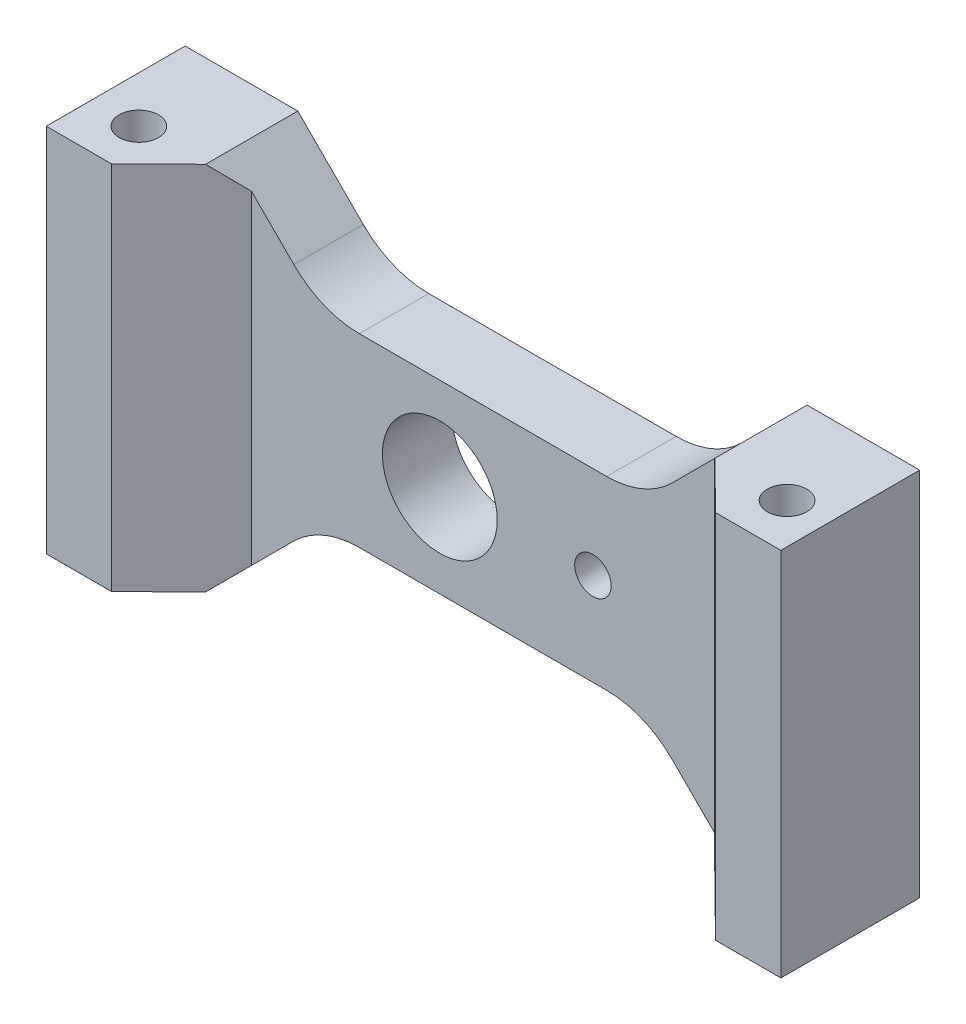
ISO-10303-21;
HEADER;
FILE_DESCRIPTION(('STEP AP214'),'2;1');
FILE_NAME('part.step','',(''),(''),'','','');
FILE_SCHEMA(('AUTOMOTIVE_DESIGN { 1 0 10303 214 1 1 1 1 }'));
ENDSEC;
DATA;
#1=APPLICATION_CONTEXT('core data for automotive mechanical design processes');
#2=APPLICATION_PROTOCOL_DEFINITION('international standard','automotive_design',2000,#1);
#3=PRODUCT_CONTEXT('',#1,'mechanical');
#4=PRODUCT('Part','Part','',(#3));
#5=PRODUCT_RELATED_PRODUCT_CATEGORY('part','',(#4));
#6=PRODUCT_DEFINITION_FORMATION('','',#4);
#7=PRODUCT_DEFINITION_CONTEXT('part definition',#1,'design');
#8=PRODUCT_DEFINITION('design','',#6,#7);
#9=PRODUCT_DEFINITION_SHAPE('','',#8);
#10=(LENGTH_UNIT() NAMED_UNIT(*) SI_UNIT(.MILLI.,.METRE.));
#11=(NAMED_UNIT(*) PLANE_ANGLE_UNIT() SI_UNIT($,.RADIAN.));
#12=(NAMED_UNIT(*) SI_UNIT($,.STERADIAN.) SOLID_ANGLE_UNIT());
#13=UNCERTAINTY_MEASURE_WITH_UNIT(LENGTH_MEASURE(1.E-05),#10,'distance_accuracy_value','');
#14=(GEOMETRIC_REPRESENTATION_CONTEXT(3) GLOBAL_UNCERTAINTY_ASSIGNED_CONTEXT((#13)) GLOBAL_UNIT_ASSIGNED_CONTEXT((#10,
#11,#12)) REPRESENTATION_CONTEXT('',''));
#15=CARTESIAN_POINT('',(0.,0.,0.));
#16=DIRECTION('',(0.,0.,1.));
#17=DIRECTION('',(1.,0.,0.));
#18=AXIS2_PLACEMENT_3D('',#15,#16,#17);
#19=CARTESIAN_POINT('',(0.,25.4,0.));
#20=DIRECTION('',(0.,-1.,0.));
#21=DIRECTION('',(0.,0.,-1.));
#22=AXIS2_PLACEMENT_3D('',#19,#20,#21);
#23=PLANE('',#22);
#24=CARTESIAN_POINT('',(-22.0123153285078,25.4,6.35));
#25=DIRECTION('',(0.,1.,0.));
#26=DIRECTION('',(0.,0.,1.));
#27=AXIS2_PLACEMENT_3D('',#24,#25,#26);
#28=CIRCLE('',#27,1.35255);
#29=CARTESIAN_POINT('',(-22.0123153285078,25.4,7.70255));
#30=VERTEX_POINT('',#29);
#31=EDGE_CURVE('E364',#30,#30,#28,.T.);
#32=ORIENTED_EDGE('',*,*,#31,.F.);
#33=EDGE_LOOP('',(#32));
#34=FACE_BOUND('',#33,.T.);
#35=DIRECTION('',(0.712536988742524,0.,-0.701634548517771));
#36=VECTOR('',#35,1.);
#37=CARTESIAN_POINT('',(-20.7115027293127,25.4,9.52500000000001));
#38=LINE('',#37,#36);
#39=CARTESIAN_POINT('',(-20.7115027293127,25.4,9.52500000000001));
#40=VERTEX_POINT('',#39);
#41=CARTESIAN_POINT('',(-17.4625,25.4,6.3257098590947));
#42=VERTEX_POINT('',#41);
#43=EDGE_CURVE('E371',#40,#42,#38,.T.);
#44=ORIENTED_EDGE('',*,*,#43,.T.);
#45=DIRECTION('',(0.,0.,-1.));
#46=VECTOR('',#45,1.);
#47=CARTESIAN_POINT('',(-17.4625,25.4,9.52500000000001));
#48=LINE('',#47,#46);
#49=CARTESIAN_POINT('',(-17.4625,25.4,0.));
#50=VERTEX_POINT('',#49);
#51=EDGE_CURVE('E251',#42,#50,#48,.T.);
#52=ORIENTED_EDGE('',*,*,#51,.T.);
#53=DIRECTION('',(-1.,0.,0.));
#54=VECTOR('',#53,1.);
#55=CARTESIAN_POINT('',(25.1873153285078,25.4,0.));
#56=LINE('',#55,#54);
#57=CARTESIAN_POINT('',(-25.1873153285078,25.4,0.));
#58=VERTEX_POINT('',#57);
#59=EDGE_CURVE('E382',#50,#58,#56,.T.);
#60=ORIENTED_EDGE('',*,*,#59,.T.);
#61=DIRECTION('',(0.,0.,1.));
#62=VECTOR('',#61,1.);
#63=CARTESIAN_POINT('',(-25.1873153285078,25.4,0.));
#64=LINE('',#63,#62);
#65=CARTESIAN_POINT('',(-25.1873153285078,25.4,9.52500000000001));
#66=VERTEX_POINT('',#65);
#67=EDGE_CURVE('E385',#58,#66,#64,.T.);
#68=ORIENTED_EDGE('',*,*,#67,.T.);
#69=DIRECTION('',(1.,0.,0.));
#70=VECTOR('',#69,1.);
#71=CARTESIAN_POINT('',(-25.1873153285078,25.4,9.52500000000001));
#72=LINE('',#71,#70);
#73=EDGE_CURVE('E387',#66,#40,#72,.T.);
#74=ORIENTED_EDGE('',*,*,#73,.T.);
#75=EDGE_LOOP('',(#44,#52,#60,#68,#74));
#76=FACE_BOUND('',#75,.T.);
#77=ADVANCED_FACE('F55',(#34,#76),#23,.F.);
#78=CARTESIAN_POINT('',(0.,0.,0.));
#79=DIRECTION('',(0.,-1.,0.));
#80=DIRECTION('',(0.,0.,-1.));
#81=AXIS2_PLACEMENT_3D('',#78,#79,#80);
#82=PLANE('',#81);
#83=DIRECTION('',(0.,0.,-1.));
#84=VECTOR('',#83,1.);
#85=CARTESIAN_POINT('',(17.4625,0.,9.52500000000001));
#86=LINE('',#85,#84);
#87=CARTESIAN_POINT('',(17.4625,0.,6.3257098590947));
#88=VERTEX_POINT('',#87);
#89=CARTESIAN_POINT('',(17.4625,0.,0.));
#90=VERTEX_POINT('',#89);
#91=EDGE_CURVE('E278',#88,#90,#86,.T.);
#92=ORIENTED_EDGE('',*,*,#91,.T.);
#93=DIRECTION('',(-1.,0.,0.));
#94=VECTOR('',#93,1.);
#95=CARTESIAN_POINT('',(25.1873153285078,0.,0.));
#96=LINE('',#95,#94);
#97=CARTESIAN_POINT('',(25.1873153285078,0.,0.));
#98=VERTEX_POINT('',#97);
#99=EDGE_CURVE('E401',#98,#90,#96,.T.);
#100=ORIENTED_EDGE('',*,*,#99,.F.);
#101=DIRECTION('',(0.,0.,-1.));
#102=VECTOR('',#101,1.);
#103=CARTESIAN_POINT('',(25.1873153285078,0.,9.52499999999999));
#104=LINE('',#103,#102);
#105=CARTESIAN_POINT('',(25.1873153285078,0.,9.52499999999999));
#106=VERTEX_POINT('',#105);
#107=EDGE_CURVE('E398',#106,#98,#104,.T.);
#108=ORIENTED_EDGE('',*,*,#107,.F.);
#109=DIRECTION('',(1.,0.,0.));
#110=VECTOR('',#109,1.);
#111=CARTESIAN_POINT('',(20.7115027293127,0.,9.525));
#112=LINE('',#111,#110);
#113=CARTESIAN_POINT('',(20.7115027293127,0.,9.525));
#114=VERTEX_POINT('',#113);
#115=EDGE_CURVE('E396',#114,#106,#112,.T.);
#116=ORIENTED_EDGE('',*,*,#115,.F.);
#117=DIRECTION('',(0.712536988742524,0.,0.701634548517771));
#118=VECTOR('',#117,1.);
#119=CARTESIAN_POINT('',(15.875,0.,4.76249999999999));
#120=LINE('',#119,#118);
#121=EDGE_CURVE('E394',#88,#114,#120,.T.);
#122=ORIENTED_EDGE('',*,*,#121,.F.);
#123=EDGE_LOOP('',(#92,#100,#108,#116,#122));
#124=FACE_BOUND('',#123,.T.);
#125=CARTESIAN_POINT('',(22.4376846714922,0.,6.35));
#126=DIRECTION('',(0.,1.,0.));
#127=DIRECTION('',(0.,0.,1.));
#128=AXIS2_PLACEMENT_3D('',#125,#126,#127);
#129=CIRCLE('',#128,1.35255);
#130=CARTESIAN_POINT('',(22.4376846714922,0.,7.70255));
#131=VERTEX_POINT('',#130);
#132=EDGE_CURVE('E354',#131,#131,#129,.T.);
#133=ORIENTED_EDGE('',*,*,#132,.T.);
#134=EDGE_LOOP('',(#133));
#135=FACE_BOUND('',#134,.T.);
#136=ADVANCED_FACE('F447',(#124,#135),#82,.T.);
#137=CARTESIAN_POINT('',(25.1873153285078,25.4,0.));
#138=VERTEX_POINT('',#137);
#139=CARTESIAN_POINT('',(17.4625,25.4,0.));
#140=VERTEX_POINT('',#139);
#141=EDGE_CURVE('E383',#138,#140,#56,.T.);
#142=ORIENTED_EDGE('',*,*,#141,.T.);
#143=DIRECTION('',(0.,0.,-1.));
#144=VECTOR('',#143,1.);
#145=CARTESIAN_POINT('',(17.4625,25.4,9.52500000000001));
#146=LINE('',#145,#144);
#147=CARTESIAN_POINT('',(17.4625,25.4,6.32570985909469));
#148=VERTEX_POINT('',#147);
#149=EDGE_CURVE('E71',#148,#140,#146,.T.);
#150=ORIENTED_EDGE('',*,*,#149,.F.);
#151=DIRECTION('',(0.712536988742524,0.,0.701634548517771));
#152=VECTOR('',#151,1.);
#153=CARTESIAN_POINT('',(15.875,25.4,4.76249999999999));
#154=LINE('',#153,#152);
#155=CARTESIAN_POINT('',(20.7115027293127,25.4,9.525));
#156=VERTEX_POINT('',#155);
#157=EDGE_CURVE('E375',#148,#156,#154,.T.);
#158=ORIENTED_EDGE('',*,*,#157,.T.);
#159=DIRECTION('',(1.,0.,0.));
#160=VECTOR('',#159,1.);
#161=CARTESIAN_POINT('',(20.7115027293127,25.4,9.525));
#162=LINE('',#161,#160);
#163=CARTESIAN_POINT('',(25.1873153285078,25.4,9.52499999999999));
#164=VERTEX_POINT('',#163);
#165=EDGE_CURVE('E378',#156,#164,#162,.T.);
#166=ORIENTED_EDGE('',*,*,#165,.T.);
#167=DIRECTION('',(0.,0.,-1.));
#168=VECTOR('',#167,1.);
#169=CARTESIAN_POINT('',(25.1873153285078,25.4,9.52499999999999));
#170=LINE('',#169,#168);
#171=EDGE_CURVE('E380',#164,#138,#170,.T.);
#172=ORIENTED_EDGE('',*,*,#171,.T.);
#173=EDGE_LOOP('',(#142,#150,#158,#166,#172));
#174=FACE_BOUND('',#173,.T.);
#175=CARTESIAN_POINT('',(22.4376846714922,25.4,6.35));
#176=DIRECTION('',(0.,1.,0.));
#177=DIRECTION('',(0.,0.,1.));
#178=AXIS2_PLACEMENT_3D('',#175,#176,#177);
#179=CIRCLE('',#178,1.35255);
#180=CARTESIAN_POINT('',(22.4376846714922,25.4,7.70255));
#181=VERTEX_POINT('',#180);
#182=EDGE_CURVE('E358',#181,#181,#179,.T.);
#183=ORIENTED_EDGE('',*,*,#182,.F.);
#184=EDGE_LOOP('',(#183));
#185=FACE_BOUND('',#184,.T.);
#186=ADVANCED_FACE('F458',(#174,#185),#23,.F.);
#187=DIRECTION('',(0.,0.,-1.));
#188=VECTOR('',#187,1.);
#189=CARTESIAN_POINT('',(-17.4625,0.,9.52500000000001));
#190=LINE('',#189,#188);
#191=CARTESIAN_POINT('',(-17.4625,0.,6.3257098590947));
#192=VERTEX_POINT('',#191);
#193=CARTESIAN_POINT('',(-17.4625,0.,0.));
#194=VERTEX_POINT('',#193);
#195=EDGE_CURVE('E82',#192,#194,#190,.T.);
#196=ORIENTED_EDGE('',*,*,#195,.F.);
#197=DIRECTION('',(0.712536988742524,0.,-0.701634548517771));
#198=VECTOR('',#197,1.);
#199=CARTESIAN_POINT('',(-20.7115027293127,0.,9.52500000000001));
#200=LINE('',#199,#198);
#201=CARTESIAN_POINT('',(-20.7115027293127,0.,9.52500000000001));
#202=VERTEX_POINT('',#201);
#203=EDGE_CURVE('E367',#202,#192,#200,.T.);
#204=ORIENTED_EDGE('',*,*,#203,.F.);
#205=DIRECTION('',(1.,0.,0.));
#206=VECTOR('',#205,1.);
#207=CARTESIAN_POINT('',(-25.1873153285078,0.,9.52500000000001));
#208=LINE('',#207,#206);
#209=CARTESIAN_POINT('',(-25.1873153285078,0.,9.52500000000001));
#210=VERTEX_POINT('',#209);
#211=EDGE_CURVE('E376',#210,#202,#208,.T.);
#212=ORIENTED_EDGE('',*,*,#211,.F.);
#213=DIRECTION('',(0.,0.,1.));
#214=VECTOR('',#213,1.);
#215=CARTESIAN_POINT('',(-25.1873153285078,0.,0.));
#216=LINE('',#215,#214);
#217=CARTESIAN_POINT('',(-25.1873153285078,0.,0.));
#218=VERTEX_POINT('',#217);
#219=EDGE_CURVE('E404',#218,#210,#216,.T.);
#220=ORIENTED_EDGE('',*,*,#219,.F.);
#221=EDGE_CURVE('E400',#194,#218,#96,.T.);
#222=ORIENTED_EDGE('',*,*,#221,.F.);
#223=EDGE_LOOP('',(#196,#204,#212,#220,#222));
#224=FACE_BOUND('',#223,.T.);
#225=CARTESIAN_POINT('',(-22.0123153285078,0.,6.35));
#226=DIRECTION('',(0.,1.,0.));
#227=DIRECTION('',(0.,0.,1.));
#228=AXIS2_PLACEMENT_3D('',#225,#226,#227);
#229=CIRCLE('',#228,1.35255);
#230=CARTESIAN_POINT('',(-22.0123153285078,0.,7.70255));
#231=VERTEX_POINT('',#230);
#232=EDGE_CURVE('E361',#231,#231,#229,.T.);
#233=ORIENTED_EDGE('',*,*,#232,.T.);
#234=EDGE_LOOP('',(#233));
#235=FACE_BOUND('',#234,.T.);
#236=ADVANCED_FACE('F482',(#224,#235),#82,.T.);
#237=CARTESIAN_POINT('',(-20.7115027293127,25.4,9.52500000000001));
#238=DIRECTION('',(-0.701634548517771,0.,-0.712536988742524));
#239=DIRECTION('',(-0.712536988742524,0.,0.701634548517771));
#240=AXIS2_PLACEMENT_3D('',#237,#238,#239);
#241=PLANE('',#240);
#242=DIRECTION('',(0.,-1.,0.));
#243=VECTOR('',#242,1.);
#244=CARTESIAN_POINT('',(-15.875,25.4,4.7625));
#245=LINE('',#244,#243);
#246=CARTESIAN_POINT('',(-15.875,23.8125,4.7625));
#247=VERTEX_POINT('',#246);
#248=CARTESIAN_POINT('',(-15.875,1.5875,4.7625));
#249=VERTEX_POINT('',#248);
#250=EDGE_CURVE('E11',#247,#249,#245,.T.);
#251=ORIENTED_EDGE('',*,*,#250,.F.);
#252=DIRECTION('',(-0.580294769610921,0.580294769610924,0.571415751204333));
#253=VECTOR('',#252,1.);
#254=CARTESIAN_POINT('',(-19.6174269884352,27.5549269884352,8.44766457654426));
#255=LINE('',#254,#253);
#256=EDGE_CURVE('E338',#247,#42,#255,.T.);
#257=ORIENTED_EDGE('',*,*,#256,.T.);
#258=ORIENTED_EDGE('',*,*,#43,.F.);
#259=DIRECTION('',(0.,-1.,0.));
#260=VECTOR('',#259,1.);
#261=CARTESIAN_POINT('',(-20.7115027293127,25.4,9.52500000000001));
#262=LINE('',#261,#260);
#263=EDGE_CURVE('E390',#40,#202,#262,.T.);
#264=ORIENTED_EDGE('',*,*,#263,.T.);
#265=ORIENTED_EDGE('',*,*,#203,.T.);
#266=DIRECTION('',(0.580294769610921,0.580294769610924,-0.571415751204333));
#267=VECTOR('',#266,1.);
#268=CARTESIAN_POINT('',(-11.0641796896353,6.39832031036476,0.0252894554361068));
#269=LINE('',#268,#267);
#270=EDGE_CURVE('E299',#192,#249,#269,.T.);
#271=ORIENTED_EDGE('',*,*,#270,.T.);
#272=EDGE_LOOP('',(#251,#257,#258,#264,#265,#271));
#273=FACE_BOUND('',#272,.T.);
#274=ADVANCED_FACE('F57',(#273),#241,.F.);
#275=CARTESIAN_POINT('',(-15.875,25.4,4.7625));
#276=DIRECTION('',(0.,0.,-1.));
#277=DIRECTION('',(-1.,0.,0.));
#278=AXIS2_PLACEMENT_3D('',#275,#276,#277);
#279=PLANE('',#278);
#280=CARTESIAN_POINT('',(7.53768467149228,12.6999999999994,4.7625));
#281=DIRECTION('',(0.,0.,1.));
#282=DIRECTION('',(1.,0.,0.));
#283=AXIS2_PLACEMENT_3D('',#280,#281,#282);
#284=CIRCLE('',#283,1.25);
#285=CARTESIAN_POINT('',(8.78768467149228,12.6999999999994,4.7625));
#286=VERTEX_POINT('',#285);
#287=EDGE_CURVE('E342',#286,#286,#284,.T.);
#288=ORIENTED_EDGE('',*,*,#287,.F.);
#289=EDGE_LOOP('',(#288));
#290=FACE_BOUND('',#289,.T.);
#291=CARTESIAN_POINT('',(-2.96231532850779,12.7,4.7625));
#292=DIRECTION('',(0.,0.,1.));
#293=DIRECTION('',(1.,0.,0.));
#294=AXIS2_PLACEMENT_3D('',#291,#292,#293);
#295=CIRCLE('',#294,3.937);
#296=CARTESIAN_POINT('',(0.974684671492209,12.7,4.7625));
#297=VERTEX_POINT('',#296);
#298=EDGE_CURVE('E349',#297,#297,#295,.T.);
#299=ORIENTED_EDGE('',*,*,#298,.F.);
#300=EDGE_LOOP('',(#299));
#301=FACE_BOUND('',#300,.T.);
#302=CARTESIAN_POINT('',(-8.48224387893086,25.4,4.7625));
#303=DIRECTION('',(0.,0.,-1.));
#304=DIRECTION('',(-1.,0.,0.));
#305=AXIS2_PLACEMENT_3D('',#302,#303,#304);
#306=CIRCLE('',#305,6.35);
#307=CARTESIAN_POINT('',(-8.48224387893083,19.05,4.7625));
#308=VERTEX_POINT('',#307);
#309=CARTESIAN_POINT('',(-12.9723719394655,20.9098719394654,4.7625));
#310=VERTEX_POINT('',#309);
#311=EDGE_CURVE('E330',#308,#310,#306,.T.);
#312=ORIENTED_EDGE('',*,*,#311,.T.);
#313=DIRECTION('',(-0.707106781186546,0.707106781186549,0.));
#314=VECTOR('',#313,1.);
#315=CARTESIAN_POINT('',(-16.66875,24.60625,4.7625));
#316=LINE('',#315,#314);
#317=EDGE_CURVE('E334',#310,#247,#316,.T.);
#318=ORIENTED_EDGE('',*,*,#317,.T.);
#319=ORIENTED_EDGE('',*,*,#250,.T.);
#320=DIRECTION('',(0.707106781186546,0.707106781186549,0.));
#321=VECTOR('',#320,1.);
#322=CARTESIAN_POINT('',(-3.96875,13.4937500000001,4.7625));
#323=LINE('',#322,#321);
#324=CARTESIAN_POINT('',(-12.9723719394655,4.49012806053455,4.7625));
#325=VERTEX_POINT('',#324);
#326=EDGE_CURVE('E254',#249,#325,#323,.T.);
#327=ORIENTED_EDGE('',*,*,#326,.T.);
#328=CARTESIAN_POINT('',(-8.48224387893086,0.,4.7625));
#329=DIRECTION('',(0.,0.,-1.));
#330=DIRECTION('',(-1.,0.,0.));
#331=AXIS2_PLACEMENT_3D('',#328,#329,#330);
#332=CIRCLE('',#331,6.35);
#333=CARTESIAN_POINT('',(-8.48224387893084,6.35,4.7625));
#334=VERTEX_POINT('',#333);
#335=EDGE_CURVE('E303',#325,#334,#332,.T.);
#336=ORIENTED_EDGE('',*,*,#335,.T.);
#337=DIRECTION('',(1.,0.,0.));
#338=VECTOR('',#337,1.);
#339=CARTESIAN_POINT('',(-15.875,6.35,4.7625));
#340=LINE('',#339,#338);
#341=CARTESIAN_POINT('',(8.48224387893084,6.35,4.7625));
#342=VERTEX_POINT('',#341);
#343=EDGE_CURVE('E307',#334,#342,#340,.T.);
#344=ORIENTED_EDGE('',*,*,#343,.T.);
#345=CARTESIAN_POINT('',(8.48224387893086,0.,4.7625));
#346=DIRECTION('',(0.,0.,-1.));
#347=DIRECTION('',(-1.,0.,0.));
#348=AXIS2_PLACEMENT_3D('',#345,#346,#347);
#349=CIRCLE('',#348,6.35);
#350=CARTESIAN_POINT('',(12.9723719394655,4.49012806053455,4.7625));
#351=VERTEX_POINT('',#350);
#352=EDGE_CURVE('E310',#342,#351,#349,.T.);
#353=ORIENTED_EDGE('',*,*,#352,.T.);
#354=DIRECTION('',(0.707106781186546,-0.707106781186549,0.));
#355=VECTOR('',#354,1.);
#356=CARTESIAN_POINT('',(-11.9062499999999,29.3687500000001,4.7625));
#357=LINE('',#356,#355);
#358=CARTESIAN_POINT('',(15.875,1.58750000000001,4.76249999999999));
#359=VERTEX_POINT('',#358);
#360=EDGE_CURVE('E316',#351,#359,#357,.T.);
#361=ORIENTED_EDGE('',*,*,#360,.T.);
#362=DIRECTION('',(0.,-1.,0.));
#363=VECTOR('',#362,1.);
#364=CARTESIAN_POINT('',(15.875,25.4,4.76249999999999));
#365=LINE('',#364,#363);
#366=CARTESIAN_POINT('',(15.875,23.8125,4.76249999999999));
#367=VERTEX_POINT('',#366);
#368=EDGE_CURVE('E64',#367,#359,#365,.T.);
#369=ORIENTED_EDGE('',*,*,#368,.F.);
#370=DIRECTION('',(-0.707106781186546,-0.707106781186549,0.));
#371=VECTOR('',#370,1.);
#372=CARTESIAN_POINT('',(0.793750000000079,8.73124999999999,4.7625));
#373=LINE('',#372,#371);
#374=CARTESIAN_POINT('',(12.9723719394655,20.9098719394654,4.76249999999999));
#375=VERTEX_POINT('',#374);
#376=EDGE_CURVE('E322',#367,#375,#373,.T.);
#377=ORIENTED_EDGE('',*,*,#376,.T.);
#378=CARTESIAN_POINT('',(8.48224387893086,25.4,4.7625));
#379=DIRECTION('',(0.,0.,-1.));
#380=DIRECTION('',(-1.,0.,0.));
#381=AXIS2_PLACEMENT_3D('',#378,#379,#380);
#382=CIRCLE('',#381,6.35);
#383=CARTESIAN_POINT('',(8.48224387893083,19.05,4.7625));
#384=VERTEX_POINT('',#383);
#385=EDGE_CURVE('E221',#375,#384,#382,.T.);
#386=ORIENTED_EDGE('',*,*,#385,.T.);
#387=DIRECTION('',(-1.,0.,0.));
#388=VECTOR('',#387,1.);
#389=CARTESIAN_POINT('',(-15.875,19.05,4.7625));
#390=LINE('',#389,#388);
#391=EDGE_CURVE('E326',#384,#308,#390,.T.);
#392=ORIENTED_EDGE('',*,*,#391,.T.);
#393=EDGE_LOOP('',(#312,#318,#319,#327,#336,#344,#353,#361,#369,#377,#386,#392));
#394=FACE_BOUND('',#393,.T.);
#395=ADVANCED_FACE('F435',(#290,#301,#394),#279,.F.);
#396=CARTESIAN_POINT('',(15.875,25.4,4.76249999999999));
#397=DIRECTION('',(0.701634548517771,0.,-0.712536988742524));
#398=DIRECTION('',(-0.712536988742524,0.,-0.701634548517771));
#399=AXIS2_PLACEMENT_3D('',#396,#397,#398);
#400=PLANE('',#399);
#401=ORIENTED_EDGE('',*,*,#157,.F.);
#402=DIRECTION('',(-0.580294769610921,-0.580294769610924,-0.571415751204333));
#403=VECTOR('',#402,1.);
#404=CARTESIAN_POINT('',(16.409577956175,24.347077956175,5.28889844506926));
#405=LINE('',#404,#403);
#406=EDGE_CURVE('E319',#148,#367,#405,.T.);
#407=ORIENTED_EDGE('',*,*,#406,.T.);
#408=ORIENTED_EDGE('',*,*,#368,.T.);
#409=DIRECTION('',(0.580294769610922,-0.580294769610924,0.571415751204333));
#410=VECTOR('',#409,1.);
#411=CARTESIAN_POINT('',(7.85633065737503,9.606169342625,-3.1334766760389));
#412=LINE('',#411,#410);
#413=EDGE_CURVE('E313',#359,#88,#412,.T.);
#414=ORIENTED_EDGE('',*,*,#413,.T.);
#415=ORIENTED_EDGE('',*,*,#121,.T.);
#416=DIRECTION('',(0.,-1.,0.));
#417=VECTOR('',#416,1.);
#418=CARTESIAN_POINT('',(20.7115027293127,25.4,9.525));
#419=LINE('',#418,#417);
#420=EDGE_CURVE('E426',#156,#114,#419,.T.);
#421=ORIENTED_EDGE('',*,*,#420,.F.);
#422=EDGE_LOOP('',(#401,#407,#408,#414,#415,#421));
#423=FACE_BOUND('',#422,.T.);
#424=ADVANCED_FACE('F432',(#423),#400,.F.);
#425=CARTESIAN_POINT('',(20.7115027293127,25.4,9.525));
#426=DIRECTION('',(0.,0.,-1.));
#427=DIRECTION('',(-1.,0.,0.));
#428=AXIS2_PLACEMENT_3D('',#425,#426,#427);
#429=PLANE('',#428);
#430=ORIENTED_EDGE('',*,*,#115,.T.);
#431=DIRECTION('',(0.,-1.,0.));
#432=VECTOR('',#431,1.);
#433=CARTESIAN_POINT('',(25.1873153285078,25.4,9.52499999999999));
#434=LINE('',#433,#432);
#435=EDGE_CURVE('E423',#164,#106,#434,.T.);
#436=ORIENTED_EDGE('',*,*,#435,.F.);
#437=ORIENTED_EDGE('',*,*,#165,.F.);
#438=ORIENTED_EDGE('',*,*,#420,.T.);
#439=EDGE_LOOP('',(#430,#436,#437,#438));
#440=FACE_BOUND('',#439,.T.);
#441=ADVANCED_FACE('F454',(#440),#429,.F.);
#442=CARTESIAN_POINT('',(25.1873153285078,25.4,9.52499999999999));
#443=DIRECTION('',(-1.,0.,0.));
#444=DIRECTION('',(0.,0.,1.));
#445=AXIS2_PLACEMENT_3D('',#442,#443,#444);
#446=PLANE('',#445);
#447=ORIENTED_EDGE('',*,*,#107,.T.);
#448=DIRECTION('',(0.,-1.,0.));
#449=VECTOR('',#448,1.);
#450=CARTESIAN_POINT('',(25.1873153285078,25.4,0.));
#451=LINE('',#450,#449);
#452=EDGE_CURVE('E420',#138,#98,#451,.T.);
#453=ORIENTED_EDGE('',*,*,#452,.F.);
#454=ORIENTED_EDGE('',*,*,#171,.F.);
#455=ORIENTED_EDGE('',*,*,#435,.T.);
#456=EDGE_LOOP('',(#447,#453,#454,#455));
#457=FACE_BOUND('',#456,.T.);
#458=ADVANCED_FACE('F462',(#457),#446,.F.);
#459=CARTESIAN_POINT('',(25.1873153285078,25.4,0.));
#460=DIRECTION('',(0.,0.,1.));
#461=DIRECTION('',(1.,0.,0.));
#462=AXIS2_PLACEMENT_3D('',#459,#460,#461);
#463=PLANE('',#462);
#464=CARTESIAN_POINT('',(7.53768467149228,12.6999999999994,0.));
#465=DIRECTION('',(0.,0.,1.));
#466=DIRECTION('',(1.,0.,0.));
#467=AXIS2_PLACEMENT_3D('',#464,#465,#466);
#468=CIRCLE('',#467,1.25);
#469=CARTESIAN_POINT('',(8.78768467149228,12.6999999999994,0.));
#470=VERTEX_POINT('',#469);
#471=EDGE_CURVE('E346',#470,#470,#468,.T.);
#472=ORIENTED_EDGE('',*,*,#471,.T.);
#473=EDGE_LOOP('',(#472));
#474=FACE_BOUND('',#473,.T.);
#475=CARTESIAN_POINT('',(-2.96231532850779,12.7,0.));
#476=DIRECTION('',(0.,0.,1.));
#477=DIRECTION('',(1.,0.,0.));
#478=AXIS2_PLACEMENT_3D('',#475,#476,#477);
#479=CIRCLE('',#478,3.937);
#480=CARTESIAN_POINT('',(0.974684671492209,12.7,0.));
#481=VERTEX_POINT('',#480);
#482=EDGE_CURVE('E350',#481,#481,#479,.T.);
#483=ORIENTED_EDGE('',*,*,#482,.T.);
#484=EDGE_LOOP('',(#483));
#485=FACE_BOUND('',#484,.T.);
#486=ORIENTED_EDGE('',*,*,#59,.F.);
#487=DIRECTION('',(-0.707106781186546,0.707106781186549,0.));
#488=VECTOR('',#487,1.);
#489=CARTESIAN_POINT('',(-12.9723719394655,20.9098719394654,0.));
#490=LINE('',#489,#488);
#491=CARTESIAN_POINT('',(-12.9723719394655,20.9098719394654,0.));
#492=VERTEX_POINT('',#491);
#493=EDGE_CURVE('E248',#492,#50,#490,.T.);
#494=ORIENTED_EDGE('',*,*,#493,.F.);
#495=CARTESIAN_POINT('',(-8.48224387893086,25.4,0.));
#496=DIRECTION('',(0.,0.,-1.));
#497=DIRECTION('',(-1.,0.,0.));
#498=AXIS2_PLACEMENT_3D('',#495,#496,#497);
#499=CIRCLE('',#498,6.35);
#500=CARTESIAN_POINT('',(-8.48224387893084,19.05,0.));
#501=VERTEX_POINT('',#500);
#502=EDGE_CURVE('E242',#501,#492,#499,.T.);
#503=ORIENTED_EDGE('',*,*,#502,.F.);
#504=DIRECTION('',(-1.,0.,0.));
#505=VECTOR('',#504,1.);
#506=CARTESIAN_POINT('',(8.48224387893083,19.05,0.));
#507=LINE('',#506,#505);
#508=CARTESIAN_POINT('',(8.48224387893083,19.05,0.));
#509=VERTEX_POINT('',#508);
#510=EDGE_CURVE('E236',#509,#501,#507,.T.);
#511=ORIENTED_EDGE('',*,*,#510,.F.);
#512=CARTESIAN_POINT('',(8.48224387893086,25.4,0.));
#513=DIRECTION('',(0.,0.,-1.));
#514=DIRECTION('',(1.,0.,0.));
#515=AXIS2_PLACEMENT_3D('',#512,#513,#514);
#516=CIRCLE('',#515,6.35);
#517=CARTESIAN_POINT('',(12.9723719394655,20.9098719394654,0.));
#518=VERTEX_POINT('',#517);
#519=EDGE_CURVE('E218',#518,#509,#516,.T.);
#520=ORIENTED_EDGE('',*,*,#519,.F.);
#521=DIRECTION('',(-0.707106781186546,-0.707106781186549,0.));
#522=VECTOR('',#521,1.);
#523=CARTESIAN_POINT('',(17.4625,25.4,0.));
#524=LINE('',#523,#522);
#525=EDGE_CURVE('E225',#140,#518,#524,.T.);
#526=ORIENTED_EDGE('',*,*,#525,.F.);
#527=ORIENTED_EDGE('',*,*,#141,.F.);
#528=ORIENTED_EDGE('',*,*,#452,.T.);
#529=ORIENTED_EDGE('',*,*,#99,.T.);
#530=DIRECTION('',(0.707106781186546,-0.707106781186549,0.));
#531=VECTOR('',#530,1.);
#532=CARTESIAN_POINT('',(17.4625,0.,0.));
#533=LINE('',#532,#531);
#534=CARTESIAN_POINT('',(12.9723719394655,4.49012806053455,0.));
#535=VERTEX_POINT('',#534);
#536=EDGE_CURVE('E266',#535,#90,#533,.T.);
#537=ORIENTED_EDGE('',*,*,#536,.F.);
#538=CARTESIAN_POINT('',(8.48224387893086,0.,0.));
#539=DIRECTION('',(0.,0.,-1.));
#540=DIRECTION('',(1.,0.,0.));
#541=AXIS2_PLACEMENT_3D('',#538,#539,#540);
#542=CIRCLE('',#541,6.35);
#543=CARTESIAN_POINT('',(8.48224387893083,6.35,0.));
#544=VERTEX_POINT('',#543);
#545=EDGE_CURVE('E282',#544,#535,#542,.T.);
#546=ORIENTED_EDGE('',*,*,#545,.F.);
#547=DIRECTION('',(1.,0.,0.));
#548=VECTOR('',#547,1.);
#549=CARTESIAN_POINT('',(8.48224387893083,6.35,0.));
#550=LINE('',#549,#548);
#551=CARTESIAN_POINT('',(-8.48224387893084,6.35,0.));
#552=VERTEX_POINT('',#551);
#553=EDGE_CURVE('E286',#552,#544,#550,.T.);
#554=ORIENTED_EDGE('',*,*,#553,.F.);
#555=CARTESIAN_POINT('',(-8.48224387893087,0.,0.));
#556=DIRECTION('',(0.,0.,-1.));
#557=DIRECTION('',(-1.,0.,0.));
#558=AXIS2_PLACEMENT_3D('',#555,#556,#557);
#559=CIRCLE('',#558,6.35);
#560=CARTESIAN_POINT('',(-12.9723719394655,4.49012806053455,0.));
#561=VERTEX_POINT('',#560);
#562=EDGE_CURVE('E290',#561,#552,#559,.T.);
#563=ORIENTED_EDGE('',*,*,#562,.F.);
#564=DIRECTION('',(0.707106781186546,0.707106781186549,0.));
#565=VECTOR('',#564,1.);
#566=CARTESIAN_POINT('',(-12.9723719394655,4.49012806053455,0.));
#567=LINE('',#566,#565);
#568=EDGE_CURVE('E230',#194,#561,#567,.T.);
#569=ORIENTED_EDGE('',*,*,#568,.F.);
#570=ORIENTED_EDGE('',*,*,#221,.T.);
#571=DIRECTION('',(0.,-1.,0.));
#572=VECTOR('',#571,1.);
#573=CARTESIAN_POINT('',(-25.1873153285078,25.4,0.));
#574=LINE('',#573,#572);
#575=EDGE_CURVE('E416',#58,#218,#574,.T.);
#576=ORIENTED_EDGE('',*,*,#575,.F.);
#577=EDGE_LOOP('',(#486,#494,#503,#511,#520,#526,#527,#528,#529,#537,#546,#554,#563,#569,#570,#576));
#578=FACE_BOUND('',#577,.T.);
#579=ADVANCED_FACE('F233',(#474,#485,#578),#463,.F.);
#580=CARTESIAN_POINT('',(-25.1873153285078,25.4,0.));
#581=DIRECTION('',(1.,0.,0.));
#582=DIRECTION('',(0.,0.,-1.));
#583=AXIS2_PLACEMENT_3D('',#580,#581,#582);
#584=PLANE('',#583);
#585=ORIENTED_EDGE('',*,*,#219,.T.);
#586=DIRECTION('',(0.,-1.,0.));
#587=VECTOR('',#586,1.);
#588=CARTESIAN_POINT('',(-25.1873153285078,25.4,9.52500000000001));
#589=LINE('',#588,#587);
#590=EDGE_CURVE('E412',#66,#210,#589,.T.);
#591=ORIENTED_EDGE('',*,*,#590,.F.);
#592=ORIENTED_EDGE('',*,*,#67,.F.);
#593=ORIENTED_EDGE('',*,*,#575,.T.);
#594=EDGE_LOOP('',(#585,#591,#592,#593));
#595=FACE_BOUND('',#594,.T.);
#596=ADVANCED_FACE('F470',(#595),#584,.F.);
#597=CARTESIAN_POINT('',(-25.1873153285078,25.4,9.52500000000001));
#598=DIRECTION('',(0.,0.,-1.));
#599=DIRECTION('',(-1.,0.,0.));
#600=AXIS2_PLACEMENT_3D('',#597,#598,#599);
#601=PLANE('',#600);
#602=ORIENTED_EDGE('',*,*,#211,.T.);
#603=ORIENTED_EDGE('',*,*,#263,.F.);
#604=ORIENTED_EDGE('',*,*,#73,.F.);
#605=ORIENTED_EDGE('',*,*,#590,.T.);
#606=EDGE_LOOP('',(#602,#603,#604,#605));
#607=FACE_BOUND('',#606,.T.);
#608=ADVANCED_FACE('F498',(#607),#601,.F.);
#609=CARTESIAN_POINT('',(-22.0123153285078,25.4,6.35));
#610=DIRECTION('',(0.,-1.,0.));
#611=DIRECTION('',(0.,0.,-1.));
#612=AXIS2_PLACEMENT_3D('',#609,#610,#611);
#613=CYLINDRICAL_SURFACE('',#612,1.35255);
#614=ORIENTED_EDGE('',*,*,#31,.T.);
#615=EDGE_LOOP('',(#614));
#616=FACE_BOUND('',#615,.T.);
#617=ORIENTED_EDGE('',*,*,#232,.F.);
#618=EDGE_LOOP('',(#617));
#619=FACE_BOUND('',#618,.T.);
#620=ADVANCED_FACE('F501',(#616,#619),#613,.F.);
#621=CARTESIAN_POINT('',(22.4376846714922,25.4,6.35));
#622=DIRECTION('',(0.,-1.,0.));
#623=DIRECTION('',(0.,0.,-1.));
#624=AXIS2_PLACEMENT_3D('',#621,#622,#623);
#625=CYLINDRICAL_SURFACE('',#624,1.35255);
#626=ORIENTED_EDGE('',*,*,#182,.T.);
#627=EDGE_LOOP('',(#626));
#628=FACE_BOUND('',#627,.T.);
#629=ORIENTED_EDGE('',*,*,#132,.F.);
#630=EDGE_LOOP('',(#629));
#631=FACE_BOUND('',#630,.T.);
#632=ADVANCED_FACE('F562',(#628,#631),#625,.F.);
#633=CARTESIAN_POINT('',(-2.96231532850779,12.7,0.));
#634=DIRECTION('',(0.,0.,1.));
#635=DIRECTION('',(1.,0.,0.));
#636=AXIS2_PLACEMENT_3D('',#633,#634,#635);
#637=CYLINDRICAL_SURFACE('',#636,3.937);
#638=ORIENTED_EDGE('',*,*,#482,.F.);
#639=EDGE_LOOP('',(#638));
#640=FACE_BOUND('',#639,.T.);
#641=ORIENTED_EDGE('',*,*,#298,.T.);
#642=EDGE_LOOP('',(#641));
#643=FACE_BOUND('',#642,.T.);
#644=ADVANCED_FACE('F559',(#640,#643),#637,.F.);
#645=CARTESIAN_POINT('',(7.53768467149228,12.6999999999994,4.7625));
#646=DIRECTION('',(0.,0.,1.));
#647=DIRECTION('',(1.,0.,0.));
#648=AXIS2_PLACEMENT_3D('',#645,#646,#647);
#649=CYLINDRICAL_SURFACE('',#648,1.25);
#650=ORIENTED_EDGE('',*,*,#471,.F.);
#651=EDGE_LOOP('',(#650));
#652=FACE_BOUND('',#651,.T.);
#653=ORIENTED_EDGE('',*,*,#287,.T.);
#654=EDGE_LOOP('',(#653));
#655=FACE_BOUND('',#654,.T.);
#656=ADVANCED_FACE('F556',(#652,#655),#649,.F.);
#657=CARTESIAN_POINT('',(17.4625,0.,9.52500000000001));
#658=DIRECTION('',(0.707106781186549,0.707106781186546,0.));
#659=DIRECTION('',(-0.707106781186546,0.707106781186549,0.));
#660=AXIS2_PLACEMENT_3D('',#657,#658,#659);
#661=PLANE('',#660);
#662=DIRECTION('',(0.,0.,-1.));
#663=VECTOR('',#662,1.);
#664=CARTESIAN_POINT('',(12.9723719394655,4.49012806053455,9.52500000000001));
#665=LINE('',#664,#663);
#666=EDGE_CURVE('E276',#351,#535,#665,.T.);
#667=ORIENTED_EDGE('',*,*,#666,.T.);
#668=ORIENTED_EDGE('',*,*,#536,.T.);
#669=ORIENTED_EDGE('',*,*,#91,.F.);
#670=ORIENTED_EDGE('',*,*,#413,.F.);
#671=ORIENTED_EDGE('',*,*,#360,.F.);
#672=EDGE_LOOP('',(#667,#668,#669,#670,#671));
#673=FACE_BOUND('',#672,.T.);
#674=ADVANCED_FACE('F438',(#673),#661,.F.);
#675=CARTESIAN_POINT('',(8.48224387893086,0.,9.52500000000001));
#676=DIRECTION('',(0.,0.,-1.));
#677=DIRECTION('',(-1.,0.,0.));
#678=AXIS2_PLACEMENT_3D('',#675,#676,#677);
#679=CYLINDRICAL_SURFACE('',#678,6.35);
#680=DIRECTION('',(0.,0.,-1.));
#681=VECTOR('',#680,1.);
#682=CARTESIAN_POINT('',(8.48224387893084,6.35,9.52500000000001));
#683=LINE('',#682,#681);
#684=EDGE_CURVE('E273',#342,#544,#683,.T.);
#685=ORIENTED_EDGE('',*,*,#684,.T.);
#686=ORIENTED_EDGE('',*,*,#545,.T.);
#687=ORIENTED_EDGE('',*,*,#666,.F.);
#688=ORIENTED_EDGE('',*,*,#352,.F.);
#689=EDGE_LOOP('',(#685,#686,#687,#688));
#690=FACE_BOUND('',#689,.T.);
#691=ADVANCED_FACE('F440',(#690),#679,.F.);
#692=CARTESIAN_POINT('',(8.48224387893084,6.35,9.52500000000001));
#693=DIRECTION('',(0.,1.,0.));
#694=DIRECTION('',(-1.,0.,0.));
#695=AXIS2_PLACEMENT_3D('',#692,#693,#694);
#696=PLANE('',#695);
#697=DIRECTION('',(0.,0.,-1.));
#698=VECTOR('',#697,1.);
#699=CARTESIAN_POINT('',(-8.48224387893084,6.35,9.52500000000001));
#700=LINE('',#699,#698);
#701=EDGE_CURVE('E270',#334,#552,#700,.T.);
#702=ORIENTED_EDGE('',*,*,#701,.T.);
#703=ORIENTED_EDGE('',*,*,#553,.T.);
#704=ORIENTED_EDGE('',*,*,#684,.F.);
#705=ORIENTED_EDGE('',*,*,#343,.F.);
#706=EDGE_LOOP('',(#702,#703,#704,#705));
#707=FACE_BOUND('',#706,.T.);
#708=ADVANCED_FACE('F548',(#707),#696,.F.);
#709=CARTESIAN_POINT('',(-8.48224387893086,0.,9.52500000000001));
#710=DIRECTION('',(0.,0.,-1.));
#711=DIRECTION('',(-1.,0.,0.));
#712=AXIS2_PLACEMENT_3D('',#709,#710,#711);
#713=CYLINDRICAL_SURFACE('',#712,6.35);
#714=DIRECTION('',(0.,0.,-1.));
#715=VECTOR('',#714,1.);
#716=CARTESIAN_POINT('',(-12.9723719394655,4.49012806053455,9.52500000000001));
#717=LINE('',#716,#715);
#718=EDGE_CURVE('E267',#325,#561,#717,.T.);
#719=ORIENTED_EDGE('',*,*,#718,.T.);
#720=ORIENTED_EDGE('',*,*,#562,.T.);
#721=ORIENTED_EDGE('',*,*,#701,.F.);
#722=ORIENTED_EDGE('',*,*,#335,.F.);
#723=EDGE_LOOP('',(#719,#720,#721,#722));
#724=FACE_BOUND('',#723,.T.);
#725=ADVANCED_FACE('F545',(#724),#713,.F.);
#726=CARTESIAN_POINT('',(-12.9723719394655,4.49012806053455,9.52500000000001));
#727=DIRECTION('',(-0.707106781186549,0.707106781186546,0.));
#728=DIRECTION('',(-0.707106781186546,-0.707106781186549,0.));
#729=AXIS2_PLACEMENT_3D('',#726,#727,#728);
#730=PLANE('',#729);
#731=ORIENTED_EDGE('',*,*,#195,.T.);
#732=ORIENTED_EDGE('',*,*,#568,.T.);
#733=ORIENTED_EDGE('',*,*,#718,.F.);
#734=ORIENTED_EDGE('',*,*,#326,.F.);
#735=ORIENTED_EDGE('',*,*,#270,.F.);
#736=EDGE_LOOP('',(#731,#732,#733,#734,#735));
#737=FACE_BOUND('',#736,.T.);
#738=ADVANCED_FACE('F521',(#737),#730,.F.);
#739=CARTESIAN_POINT('',(-12.9723719394655,20.9098719394654,9.52500000000001));
#740=DIRECTION('',(-0.707106781186549,-0.707106781186546,0.));
#741=DIRECTION('',(0.707106781186546,-0.707106781186549,0.));
#742=AXIS2_PLACEMENT_3D('',#739,#740,#741);
#743=PLANE('',#742);
#744=ORIENTED_EDGE('',*,*,#317,.F.);
#745=DIRECTION('',(0.,0.,-1.));
#746=VECTOR('',#745,1.);
#747=CARTESIAN_POINT('',(-12.9723719394655,20.9098719394654,9.52500000000001));
#748=LINE('',#747,#746);
#749=EDGE_CURVE('E255',#310,#492,#748,.T.);
#750=ORIENTED_EDGE('',*,*,#749,.T.);
#751=ORIENTED_EDGE('',*,*,#493,.T.);
#752=ORIENTED_EDGE('',*,*,#51,.F.);
#753=ORIENTED_EDGE('',*,*,#256,.F.);
#754=EDGE_LOOP('',(#744,#750,#751,#752,#753));
#755=FACE_BOUND('',#754,.T.);
#756=ADVANCED_FACE('F525',(#755),#743,.F.);
#757=CARTESIAN_POINT('',(-8.48224387893086,25.4,9.52500000000001));
#758=DIRECTION('',(0.,0.,-1.));
#759=DIRECTION('',(-1.,0.,0.));
#760=AXIS2_PLACEMENT_3D('',#757,#758,#759);
#761=CYLINDRICAL_SURFACE('',#760,6.35);
#762=DIRECTION('',(0.,0.,-1.));
#763=VECTOR('',#762,1.);
#764=CARTESIAN_POINT('',(-8.48224387893083,19.05,9.52500000000001));
#765=LINE('',#764,#763);
#766=EDGE_CURVE('E258',#308,#501,#765,.T.);
#767=ORIENTED_EDGE('',*,*,#766,.T.);
#768=ORIENTED_EDGE('',*,*,#502,.T.);
#769=ORIENTED_EDGE('',*,*,#749,.F.);
#770=ORIENTED_EDGE('',*,*,#311,.F.);
#771=EDGE_LOOP('',(#767,#768,#769,#770));
#772=FACE_BOUND('',#771,.T.);
#773=ADVANCED_FACE('F527',(#772),#761,.F.);
#774=CARTESIAN_POINT('',(8.48224387893084,19.05,9.52500000000001));
#775=DIRECTION('',(0.,-1.,0.));
#776=DIRECTION('',(0.,0.,-1.));
#777=AXIS2_PLACEMENT_3D('',#774,#775,#776);
#778=PLANE('',#777);
#779=DIRECTION('',(0.,0.,-1.));
#780=VECTOR('',#779,1.);
#781=CARTESIAN_POINT('',(8.48224387893083,19.05,9.52500000000001));
#782=LINE('',#781,#780);
#783=EDGE_CURVE('E223',#384,#509,#782,.T.);
#784=ORIENTED_EDGE('',*,*,#783,.T.);
#785=ORIENTED_EDGE('',*,*,#510,.T.);
#786=ORIENTED_EDGE('',*,*,#766,.F.);
#787=ORIENTED_EDGE('',*,*,#391,.F.);
#788=EDGE_LOOP('',(#784,#785,#786,#787));
#789=FACE_BOUND('',#788,.T.);
#790=ADVANCED_FACE('F530',(#789),#778,.F.);
#791=CARTESIAN_POINT('',(8.48224387893086,25.4,9.52500000000001));
#792=DIRECTION('',(0.,0.,-1.));
#793=DIRECTION('',(-1.,0.,0.));
#794=AXIS2_PLACEMENT_3D('',#791,#792,#793);
#795=CYLINDRICAL_SURFACE('',#794,6.35);
#796=DIRECTION('',(0.,0.,-1.));
#797=VECTOR('',#796,1.);
#798=CARTESIAN_POINT('',(12.9723719394655,20.9098719394654,9.52500000000001));
#799=LINE('',#798,#797);
#800=EDGE_CURVE('E214',#375,#518,#799,.T.);
#801=ORIENTED_EDGE('',*,*,#800,.T.);
#802=ORIENTED_EDGE('',*,*,#519,.T.);
#803=ORIENTED_EDGE('',*,*,#783,.F.);
#804=ORIENTED_EDGE('',*,*,#385,.F.);
#805=EDGE_LOOP('',(#801,#802,#803,#804));
#806=FACE_BOUND('',#805,.T.);
#807=ADVANCED_FACE('F215',(#806),#795,.F.);
#808=CARTESIAN_POINT('',(17.4625,25.4,9.52500000000001));
#809=DIRECTION('',(0.707106781186549,-0.707106781186546,0.));
#810=DIRECTION('',(0.707106781186546,0.707106781186549,0.));
#811=AXIS2_PLACEMENT_3D('',#808,#809,#810);
#812=PLANE('',#811);
#813=ORIENTED_EDGE('',*,*,#406,.F.);
#814=ORIENTED_EDGE('',*,*,#149,.T.);
#815=ORIENTED_EDGE('',*,*,#525,.T.);
#816=ORIENTED_EDGE('',*,*,#800,.F.);
#817=ORIENTED_EDGE('',*,*,#376,.F.);
#818=EDGE_LOOP('',(#813,#814,#815,#816,#817));
#819=FACE_BOUND('',#818,.T.);
#820=ADVANCED_FACE('F226',(#819),#812,.F.);
#821=CLOSED_SHELL('',(#77,#136,#186,#236,#274,#395,#424,#441,#458,#579,#596,#608,#620,#632,#644,
#656,#674,#691,#708,#725,#738,#756,#773,#790,#807,#820));
#822=MANIFOLD_SOLID_BREP('B2',#821);
#823=ADVANCED_BREP_SHAPE_REPRESENTATION('',(#18,#822),#14);
#824=SHAPE_DEFINITION_REPRESENTATION(#9,#823);
ENDSEC;
END-ISO-10303-21;
